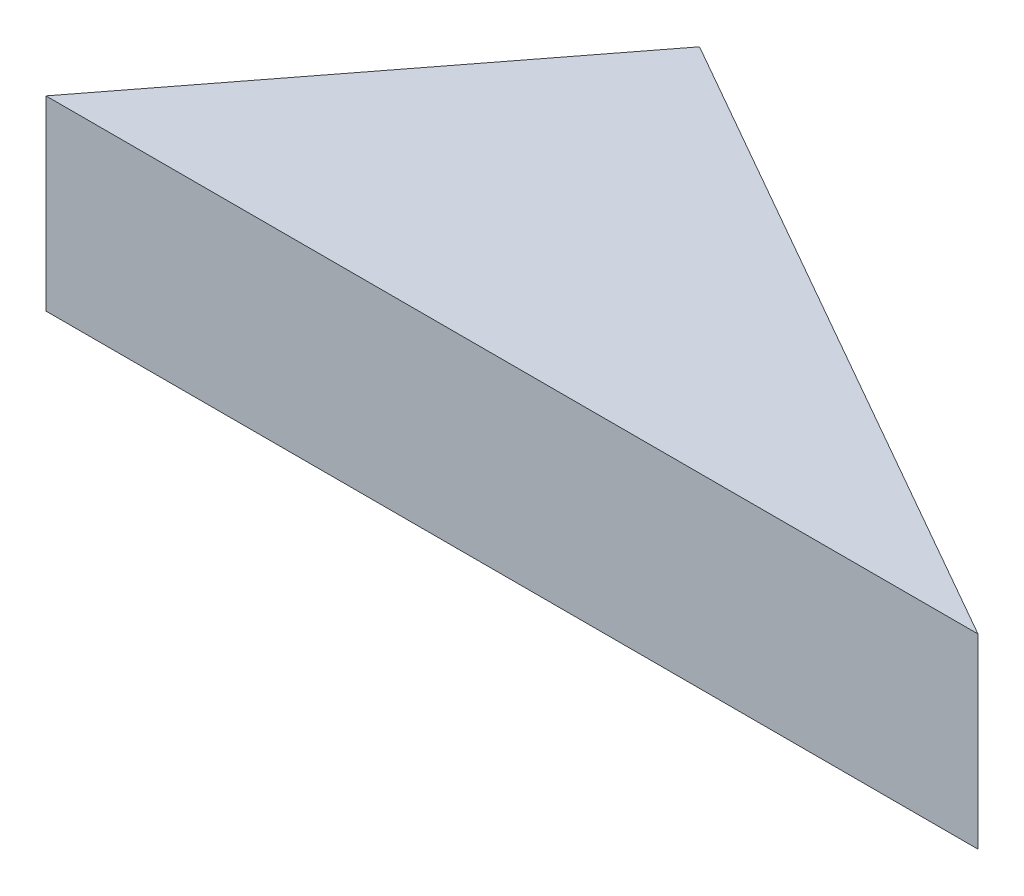
ISO-10303-21;
HEADER;
FILE_DESCRIPTION(('STEP AP214'),'2;1');
FILE_NAME('part.step','',(''),(''),'','','');
FILE_SCHEMA(('AUTOMOTIVE_DESIGN { 1 0 10303 214 1 1 1 1 }'));
ENDSEC;
DATA;
#1=APPLICATION_CONTEXT('core data for automotive mechanical design processes');
#2=APPLICATION_PROTOCOL_DEFINITION('international standard','automotive_design',2000,#1);
#3=PRODUCT_CONTEXT('',#1,'mechanical');
#4=PRODUCT('Part','Part','',(#3));
#5=PRODUCT_RELATED_PRODUCT_CATEGORY('part','',(#4));
#6=PRODUCT_DEFINITION_FORMATION('','',#4);
#7=PRODUCT_DEFINITION_CONTEXT('part definition',#1,'design');
#8=PRODUCT_DEFINITION('design','',#6,#7);
#9=PRODUCT_DEFINITION_SHAPE('','',#8);
#10=(LENGTH_UNIT() NAMED_UNIT(*) SI_UNIT(.MILLI.,.METRE.));
#11=(NAMED_UNIT(*) PLANE_ANGLE_UNIT() SI_UNIT($,.RADIAN.));
#12=(NAMED_UNIT(*) SI_UNIT($,.STERADIAN.) SOLID_ANGLE_UNIT());
#13=UNCERTAINTY_MEASURE_WITH_UNIT(LENGTH_MEASURE(1.E-05),#10,'distance_accuracy_value','');
#14=(GEOMETRIC_REPRESENTATION_CONTEXT(3) GLOBAL_UNCERTAINTY_ASSIGNED_CONTEXT((#13)) GLOBAL_UNIT_ASSIGNED_CONTEXT((#10,
#11,#12)) REPRESENTATION_CONTEXT('',''));
#15=CARTESIAN_POINT('',(0.,0.,0.));
#16=DIRECTION('',(0.,0.,1.));
#17=DIRECTION('',(1.,0.,0.));
#18=AXIS2_PLACEMENT_3D('',#15,#16,#17);
#19=CARTESIAN_POINT('',(1.525,1.,-1.98100353356575));
#20=DIRECTION('',(0.792401413426302,0.,0.61));
#21=DIRECTION('',(0.61,0.,-0.792401413426302));
#22=AXIS2_PLACEMENT_3D('',#19,#20,#21);
#23=PLANE('',#22);
#24=DIRECTION('',(-0.61,0.,0.792401413426302));
#25=VECTOR('',#24,1.);
#26=CARTESIAN_POINT('',(1.525,0.,-1.98100353356575));
#27=LINE('',#26,#25);
#28=CARTESIAN_POINT('',(1.525,0.,-1.98100353356575));
#29=VERTEX_POINT('',#28);
#30=CARTESIAN_POINT('',(0.,0.,0.));
#31=VERTEX_POINT('',#30);
#32=EDGE_CURVE('E80',#29,#31,#27,.T.);
#33=ORIENTED_EDGE('',*,*,#32,.T.);
#34=DIRECTION('',(0.,-1.,0.));
#35=VECTOR('',#34,1.);
#36=CARTESIAN_POINT('',(0.,1.,0.));
#37=LINE('',#36,#35);
#38=CARTESIAN_POINT('',(0.,1.,0.));
#39=VERTEX_POINT('',#38);
#40=EDGE_CURVE('E11',#39,#31,#37,.T.);
#41=ORIENTED_EDGE('',*,*,#40,.F.);
#42=DIRECTION('',(-0.61,0.,0.792401413426302));
#43=VECTOR('',#42,1.);
#44=CARTESIAN_POINT('',(1.525,1.,-1.98100353356575));
#45=LINE('',#44,#43);
#46=CARTESIAN_POINT('',(1.525,1.,-1.98100353356575));
#47=VERTEX_POINT('',#46);
#48=EDGE_CURVE('E73',#47,#39,#45,.T.);
#49=ORIENTED_EDGE('',*,*,#48,.F.);
#50=DIRECTION('',(0.,-1.,0.));
#51=VECTOR('',#50,1.);
#52=CARTESIAN_POINT('',(1.525,1.,-1.98100353356575));
#53=LINE('',#52,#51);
#54=EDGE_CURVE('E81',#47,#29,#53,.T.);
#55=ORIENTED_EDGE('',*,*,#54,.T.);
#56=EDGE_LOOP('',(#33,#41,#49,#55));
#57=FACE_BOUND('',#56,.T.);
#58=ADVANCED_FACE('F33',(#57),#23,.F.);
#59=CARTESIAN_POINT('',(0.,1.,0.));
#60=DIRECTION('',(0.,0.,-1.));
#61=DIRECTION('',(-1.,0.,0.));
#62=AXIS2_PLACEMENT_3D('',#59,#60,#61);
#63=PLANE('',#62);
#64=DIRECTION('',(1.,0.,0.));
#65=VECTOR('',#64,1.);
#66=CARTESIAN_POINT('',(0.,0.,0.));
#67=LINE('',#66,#65);
#68=CARTESIAN_POINT('',(5.,0.,0.));
#69=VERTEX_POINT('',#68);
#70=EDGE_CURVE('E61',#31,#69,#67,.T.);
#71=ORIENTED_EDGE('',*,*,#70,.T.);
#72=DIRECTION('',(0.,-1.,0.));
#73=VECTOR('',#72,1.);
#74=CARTESIAN_POINT('',(5.,1.,0.));
#75=LINE('',#74,#73);
#76=CARTESIAN_POINT('',(5.,1.,0.));
#77=VERTEX_POINT('',#76);
#78=EDGE_CURVE('E41',#77,#69,#75,.T.);
#79=ORIENTED_EDGE('',*,*,#78,.F.);
#80=DIRECTION('',(1.,0.,0.));
#81=VECTOR('',#80,1.);
#82=CARTESIAN_POINT('',(0.,1.,0.));
#83=LINE('',#82,#81);
#84=EDGE_CURVE('E69',#39,#77,#83,.T.);
#85=ORIENTED_EDGE('',*,*,#84,.F.);
#86=ORIENTED_EDGE('',*,*,#40,.T.);
#87=EDGE_LOOP('',(#71,#79,#85,#86));
#88=FACE_BOUND('',#87,.T.);
#89=ADVANCED_FACE('F70',(#88),#63,.F.);
#90=CARTESIAN_POINT('',(5.,1.,0.));
#91=DIRECTION('',(-0.495250883391438,0.,0.86875));
#92=DIRECTION('',(0.86875,0.,0.495250883391438));
#93=AXIS2_PLACEMENT_3D('',#90,#91,#92);
#94=PLANE('',#93);
#95=DIRECTION('',(-0.86875,0.,-0.495250883391438));
#96=VECTOR('',#95,1.);
#97=CARTESIAN_POINT('',(5.,0.,0.));
#98=LINE('',#97,#96);
#99=EDGE_CURVE('E66',#69,#29,#98,.T.);
#100=ORIENTED_EDGE('',*,*,#99,.T.);
#101=ORIENTED_EDGE('',*,*,#54,.F.);
#102=DIRECTION('',(-0.86875,0.,-0.495250883391438));
#103=VECTOR('',#102,1.);
#104=CARTESIAN_POINT('',(5.,1.,0.));
#105=LINE('',#104,#103);
#106=EDGE_CURVE('E49',#77,#47,#105,.T.);
#107=ORIENTED_EDGE('',*,*,#106,.F.);
#108=ORIENTED_EDGE('',*,*,#78,.T.);
#109=EDGE_LOOP('',(#100,#101,#107,#108));
#110=FACE_BOUND('',#109,.T.);
#111=ADVANCED_FACE('F88',(#110),#94,.F.);
#112=CARTESIAN_POINT('',(0.,1.,0.));
#113=DIRECTION('',(0.,-1.,0.));
#114=DIRECTION('',(0.,0.,-1.));
#115=AXIS2_PLACEMENT_3D('',#112,#113,#114);
#116=PLANE('',#115);
#117=ORIENTED_EDGE('',*,*,#48,.T.);
#118=ORIENTED_EDGE('',*,*,#84,.T.);
#119=ORIENTED_EDGE('',*,*,#106,.T.);
#120=EDGE_LOOP('',(#117,#118,#119));
#121=FACE_BOUND('',#120,.T.);
#122=ADVANCED_FACE('F76',(#121),#116,.F.);
#123=CARTESIAN_POINT('',(0.,0.,0.));
#124=DIRECTION('',(0.,-1.,0.));
#125=DIRECTION('',(0.,0.,-1.));
#126=AXIS2_PLACEMENT_3D('',#123,#124,#125);
#127=PLANE('',#126);
#128=ORIENTED_EDGE('',*,*,#32,.F.);
#129=ORIENTED_EDGE('',*,*,#99,.F.);
#130=ORIENTED_EDGE('',*,*,#70,.F.);
#131=EDGE_LOOP('',(#128,#129,#130));
#132=FACE_BOUND('',#131,.T.);
#133=ADVANCED_FACE('F89',(#132),#127,.T.);
#134=CLOSED_SHELL('',(#58,#89,#111,#122,#133));
#135=MANIFOLD_SOLID_BREP('B2',#134);
#136=ADVANCED_BREP_SHAPE_REPRESENTATION('',(#18,#135),#14);
#137=SHAPE_DEFINITION_REPRESENTATION(#9,#136);
ENDSEC;
END-ISO-10303-21;
